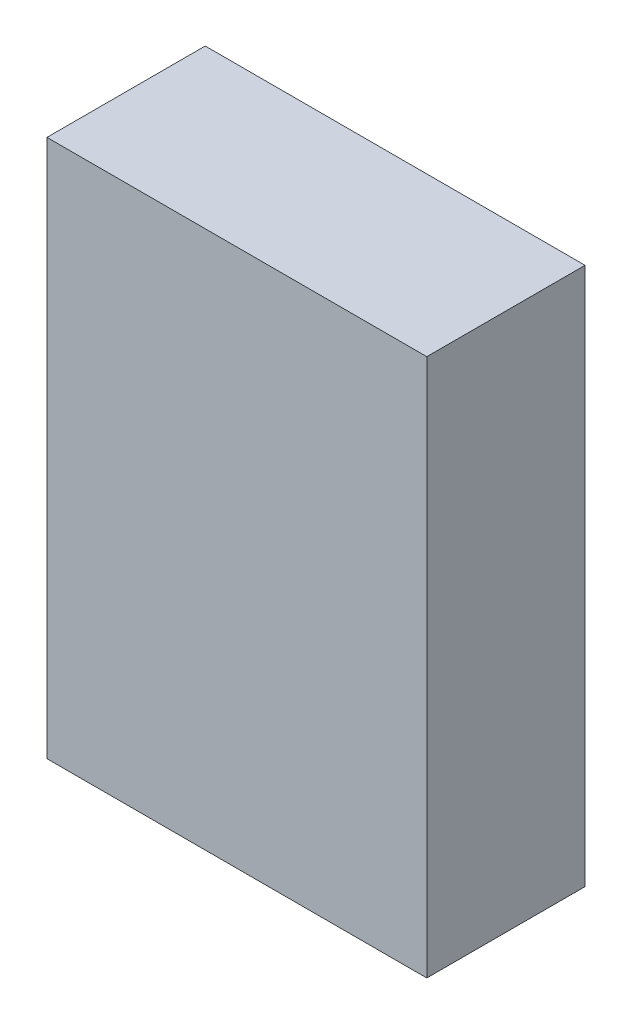
ISO-10303-21;
HEADER;
FILE_DESCRIPTION(('STEP AP214'),'2;1');
FILE_NAME('part.step','',(''),(''),'','','');
FILE_SCHEMA(('AUTOMOTIVE_DESIGN { 1 0 10303 214 1 1 1 1 }'));
ENDSEC;
DATA;
#1=APPLICATION_CONTEXT('core data for automotive mechanical design processes');
#2=APPLICATION_PROTOCOL_DEFINITION('international standard','automotive_design',2000,#1);
#3=PRODUCT_CONTEXT('',#1,'mechanical');
#4=PRODUCT('Part','Part','',(#3));
#5=PRODUCT_RELATED_PRODUCT_CATEGORY('part','',(#4));
#6=PRODUCT_DEFINITION_FORMATION('','',#4);
#7=PRODUCT_DEFINITION_CONTEXT('part definition',#1,'design');
#8=PRODUCT_DEFINITION('design','',#6,#7);
#9=PRODUCT_DEFINITION_SHAPE('','',#8);
#10=(LENGTH_UNIT() NAMED_UNIT(*) SI_UNIT(.MILLI.,.METRE.));
#11=(NAMED_UNIT(*) PLANE_ANGLE_UNIT() SI_UNIT($,.RADIAN.));
#12=(NAMED_UNIT(*) SI_UNIT($,.STERADIAN.) SOLID_ANGLE_UNIT());
#13=UNCERTAINTY_MEASURE_WITH_UNIT(LENGTH_MEASURE(1.E-05),#10,'distance_accuracy_value','');
#14=(GEOMETRIC_REPRESENTATION_CONTEXT(3) GLOBAL_UNCERTAINTY_ASSIGNED_CONTEXT((#13)) GLOBAL_UNIT_ASSIGNED_CONTEXT((#10,
#11,#12)) REPRESENTATION_CONTEXT('',''));
#15=CARTESIAN_POINT('',(0.,0.,0.));
#16=DIRECTION('',(0.,0.,1.));
#17=DIRECTION('',(1.,0.,0.));
#18=AXIS2_PLACEMENT_3D('',#15,#16,#17);
#19=CARTESIAN_POINT('',(0.13,2.58,0.));
#20=DIRECTION('',(1.,0.,0.));
#21=DIRECTION('',(0.,0.,1.));
#22=AXIS2_PLACEMENT_3D('',#19,#20,#21);
#23=PLANE('',#22);
#24=DIRECTION('',(0.,1.,0.));
#25=VECTOR('',#24,1.);
#26=CARTESIAN_POINT('',(0.13,2.58,0.1));
#27=LINE('',#26,#25);
#28=CARTESIAN_POINT('',(0.13,2.58,0.1));
#29=VERTEX_POINT('',#28);
#30=CARTESIAN_POINT('',(0.13,2.92,0.1));
#31=VERTEX_POINT('',#30);
#32=EDGE_CURVE('E11',#29,#31,#27,.T.);
#33=ORIENTED_EDGE('',*,*,#32,.T.);
#34=DIRECTION('',(0.,0.,1.));
#35=VECTOR('',#34,1.);
#36=CARTESIAN_POINT('',(0.13,2.92,0.));
#37=LINE('',#36,#35);
#38=CARTESIAN_POINT('',(0.13,2.92,0.));
#39=VERTEX_POINT('',#38);
#40=EDGE_CURVE('E24',#39,#31,#37,.T.);
#41=ORIENTED_EDGE('',*,*,#40,.F.);
#42=DIRECTION('',(0.,1.,0.));
#43=VECTOR('',#42,1.);
#44=CARTESIAN_POINT('',(0.13,2.58,0.));
#45=LINE('',#44,#43);
#46=CARTESIAN_POINT('',(0.13,2.58,0.));
#47=VERTEX_POINT('',#46);
#48=EDGE_CURVE('E86',#47,#39,#45,.T.);
#49=ORIENTED_EDGE('',*,*,#48,.F.);
#50=DIRECTION('',(0.,0.,1.));
#51=VECTOR('',#50,1.);
#52=CARTESIAN_POINT('',(0.13,2.58,0.));
#53=LINE('',#52,#51);
#54=EDGE_CURVE('E36',#47,#29,#53,.T.);
#55=ORIENTED_EDGE('',*,*,#54,.T.);
#56=EDGE_LOOP('',(#33,#41,#49,#55));
#57=FACE_BOUND('',#56,.T.);
#58=ADVANCED_FACE('F17',(#57),#23,.F.);
#59=CARTESIAN_POINT('',(0.37,2.58,0.));
#60=DIRECTION('',(1.,0.,0.));
#61=DIRECTION('',(0.,0.,1.));
#62=AXIS2_PLACEMENT_3D('',#59,#60,#61);
#63=PLANE('',#62);
#64=DIRECTION('',(0.,0.,1.));
#65=VECTOR('',#64,1.);
#66=CARTESIAN_POINT('',(0.37,2.58,0.));
#67=LINE('',#66,#65);
#68=CARTESIAN_POINT('',(0.37,2.58,0.));
#69=VERTEX_POINT('',#68);
#70=CARTESIAN_POINT('',(0.37,2.58,0.1));
#71=VERTEX_POINT('',#70);
#72=EDGE_CURVE('E83',#69,#71,#67,.T.);
#73=ORIENTED_EDGE('',*,*,#72,.F.);
#74=DIRECTION('',(0.,1.,0.));
#75=VECTOR('',#74,1.);
#76=CARTESIAN_POINT('',(0.37,2.58,0.));
#77=LINE('',#76,#75);
#78=CARTESIAN_POINT('',(0.37,2.92,0.));
#79=VERTEX_POINT('',#78);
#80=EDGE_CURVE('E63',#69,#79,#77,.T.);
#81=ORIENTED_EDGE('',*,*,#80,.T.);
#82=DIRECTION('',(0.,0.,1.));
#83=VECTOR('',#82,1.);
#84=CARTESIAN_POINT('',(0.37,2.92,0.));
#85=LINE('',#84,#83);
#86=CARTESIAN_POINT('',(0.37,2.92,0.1));
#87=VERTEX_POINT('',#86);
#88=EDGE_CURVE('E57',#79,#87,#85,.T.);
#89=ORIENTED_EDGE('',*,*,#88,.T.);
#90=DIRECTION('',(0.,1.,0.));
#91=VECTOR('',#90,1.);
#92=CARTESIAN_POINT('',(0.37,2.58,0.1));
#93=LINE('',#92,#91);
#94=EDGE_CURVE('E60',#71,#87,#93,.T.);
#95=ORIENTED_EDGE('',*,*,#94,.F.);
#96=EDGE_LOOP('',(#73,#81,#89,#95));
#97=FACE_BOUND('',#96,.T.);
#98=ADVANCED_FACE('F59',(#97),#63,.T.);
#99=CARTESIAN_POINT('',(0.13,2.58,0.));
#100=DIRECTION('',(0.,1.,0.));
#101=DIRECTION('',(0.,0.,1.));
#102=AXIS2_PLACEMENT_3D('',#99,#100,#101);
#103=PLANE('',#102);
#104=ORIENTED_EDGE('',*,*,#72,.T.);
#105=DIRECTION('',(1.,0.,0.));
#106=VECTOR('',#105,1.);
#107=CARTESIAN_POINT('',(0.13,2.58,0.1));
#108=LINE('',#107,#106);
#109=EDGE_CURVE('E71',#29,#71,#108,.T.);
#110=ORIENTED_EDGE('',*,*,#109,.F.);
#111=ORIENTED_EDGE('',*,*,#54,.F.);
#112=DIRECTION('',(1.,0.,0.));
#113=VECTOR('',#112,1.);
#114=CARTESIAN_POINT('',(0.13,2.58,0.));
#115=LINE('',#114,#113);
#116=EDGE_CURVE('E76',#47,#69,#115,.T.);
#117=ORIENTED_EDGE('',*,*,#116,.T.);
#118=EDGE_LOOP('',(#104,#110,#111,#117));
#119=FACE_BOUND('',#118,.T.);
#120=ADVANCED_FACE('F91',(#119),#103,.F.);
#121=CARTESIAN_POINT('',(0.13,2.92,0.));
#122=DIRECTION('',(0.,1.,0.));
#123=DIRECTION('',(0.,0.,1.));
#124=AXIS2_PLACEMENT_3D('',#121,#122,#123);
#125=PLANE('',#124);
#126=DIRECTION('',(1.,0.,0.));
#127=VECTOR('',#126,1.);
#128=CARTESIAN_POINT('',(0.13,2.92,0.));
#129=LINE('',#128,#127);
#130=EDGE_CURVE('E74',#39,#79,#129,.T.);
#131=ORIENTED_EDGE('',*,*,#130,.F.);
#132=ORIENTED_EDGE('',*,*,#40,.T.);
#133=DIRECTION('',(1.,0.,0.));
#134=VECTOR('',#133,1.);
#135=CARTESIAN_POINT('',(0.13,2.92,0.1));
#136=LINE('',#135,#134);
#137=EDGE_CURVE('E69',#31,#87,#136,.T.);
#138=ORIENTED_EDGE('',*,*,#137,.T.);
#139=ORIENTED_EDGE('',*,*,#88,.F.);
#140=EDGE_LOOP('',(#131,#132,#138,#139));
#141=FACE_BOUND('',#140,.T.);
#142=ADVANCED_FACE('F73',(#141),#125,.T.);
#143=CARTESIAN_POINT('',(0.13,2.58,0.));
#144=DIRECTION('',(0.,0.,1.));
#145=DIRECTION('',(1.,0.,0.));
#146=AXIS2_PLACEMENT_3D('',#143,#144,#145);
#147=PLANE('',#146);
#148=ORIENTED_EDGE('',*,*,#130,.T.);
#149=ORIENTED_EDGE('',*,*,#80,.F.);
#150=ORIENTED_EDGE('',*,*,#116,.F.);
#151=ORIENTED_EDGE('',*,*,#48,.T.);
#152=EDGE_LOOP('',(#148,#149,#150,#151));
#153=FACE_BOUND('',#152,.T.);
#154=ADVANCED_FACE('F89',(#153),#147,.F.);
#155=CARTESIAN_POINT('',(0.13,2.58,0.1));
#156=DIRECTION('',(0.,0.,1.));
#157=DIRECTION('',(1.,0.,0.));
#158=AXIS2_PLACEMENT_3D('',#155,#156,#157);
#159=PLANE('',#158);
#160=ORIENTED_EDGE('',*,*,#32,.F.);
#161=ORIENTED_EDGE('',*,*,#109,.T.);
#162=ORIENTED_EDGE('',*,*,#94,.T.);
#163=ORIENTED_EDGE('',*,*,#137,.F.);
#164=EDGE_LOOP('',(#160,#161,#162,#163));
#165=FACE_BOUND('',#164,.T.);
#166=ADVANCED_FACE('F68',(#165),#159,.T.);
#167=CLOSED_SHELL('',(#58,#98,#120,#142,#154,#166));
#168=MANIFOLD_SOLID_BREP('B1',#167);
#169=ADVANCED_BREP_SHAPE_REPRESENTATION('',(#18,#168),#14);
#170=SHAPE_DEFINITION_REPRESENTATION(#9,#169);
ENDSEC;
END-ISO-10303-21;
